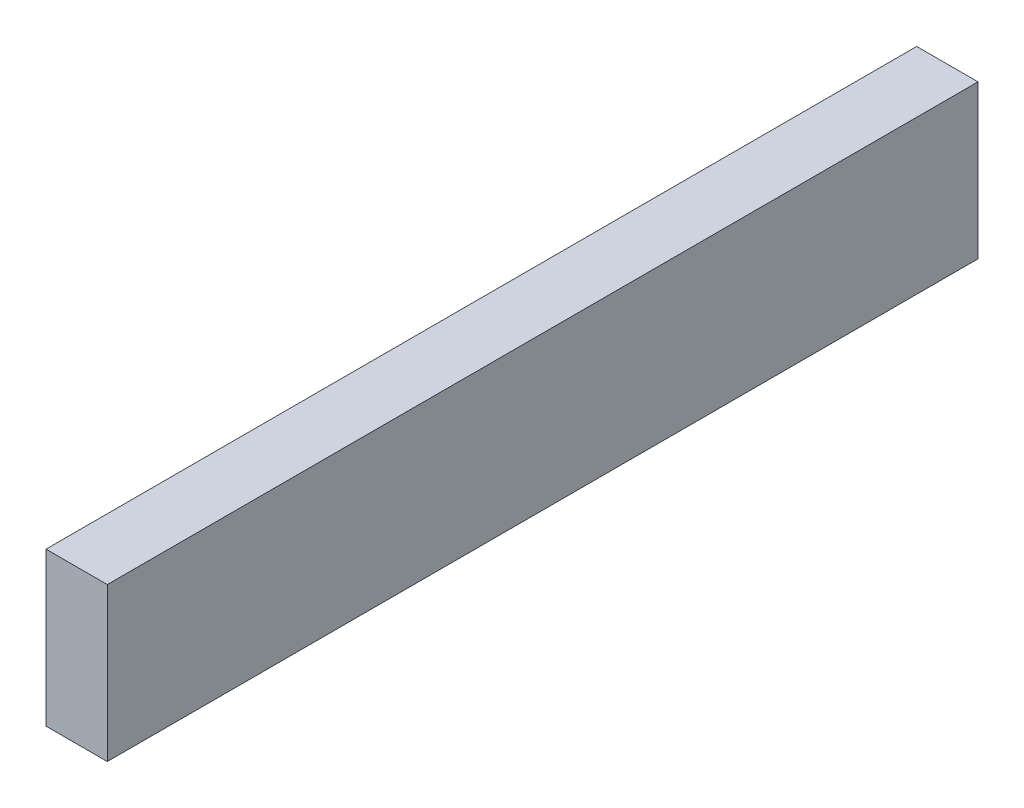
ISO-10303-21;
HEADER;
FILE_DESCRIPTION(('STEP AP214'),'2;1');
FILE_NAME('part.step','',(''),(''),'','','');
FILE_SCHEMA(('AUTOMOTIVE_DESIGN { 1 0 10303 214 1 1 1 1 }'));
ENDSEC;
DATA;
#1=APPLICATION_CONTEXT('core data for automotive mechanical design processes');
#2=APPLICATION_PROTOCOL_DEFINITION('international standard','automotive_design',2000,#1);
#3=PRODUCT_CONTEXT('',#1,'mechanical');
#4=PRODUCT('Part','Part','',(#3));
#5=PRODUCT_RELATED_PRODUCT_CATEGORY('part','',(#4));
#6=PRODUCT_DEFINITION_FORMATION('','',#4);
#7=PRODUCT_DEFINITION_CONTEXT('part definition',#1,'design');
#8=PRODUCT_DEFINITION('design','',#6,#7);
#9=PRODUCT_DEFINITION_SHAPE('','',#8);
#10=(LENGTH_UNIT() NAMED_UNIT(*) SI_UNIT(.MILLI.,.METRE.));
#11=(NAMED_UNIT(*) PLANE_ANGLE_UNIT() SI_UNIT($,.RADIAN.));
#12=(NAMED_UNIT(*) SI_UNIT($,.STERADIAN.) SOLID_ANGLE_UNIT());
#13=UNCERTAINTY_MEASURE_WITH_UNIT(LENGTH_MEASURE(1.E-05),#10,'distance_accuracy_value','');
#14=(GEOMETRIC_REPRESENTATION_CONTEXT(3) GLOBAL_UNCERTAINTY_ASSIGNED_CONTEXT((#13)) GLOBAL_UNIT_ASSIGNED_CONTEXT((#10,
#11,#12)) REPRESENTATION_CONTEXT('',''));
#15=CARTESIAN_POINT('',(0.,0.,0.));
#16=DIRECTION('',(0.,0.,1.));
#17=DIRECTION('',(1.,0.,0.));
#18=AXIS2_PLACEMENT_3D('',#15,#16,#17);
#19=CARTESIAN_POINT('',(0.,0.,1420.));
#20=DIRECTION('',(1.,0.,0.));
#21=DIRECTION('',(0.,0.,-1.));
#22=AXIS2_PLACEMENT_3D('',#19,#20,#21);
#23=PLANE('',#22);
#24=DIRECTION('',(0.,-1.,0.));
#25=VECTOR('',#24,1.);
#26=CARTESIAN_POINT('',(0.,0.,0.));
#27=LINE('',#26,#25);
#28=CARTESIAN_POINT('',(0.,250.,0.));
#29=VERTEX_POINT('',#28);
#30=CARTESIAN_POINT('',(0.,0.,0.));
#31=VERTEX_POINT('',#30);
#32=EDGE_CURVE('E98',#29,#31,#27,.T.);
#33=ORIENTED_EDGE('',*,*,#32,.T.);
#34=DIRECTION('',(0.,0.,-1.));
#35=VECTOR('',#34,1.);
#36=CARTESIAN_POINT('',(0.,0.,1420.));
#37=LINE('',#36,#35);
#38=CARTESIAN_POINT('',(0.,0.,1420.));
#39=VERTEX_POINT('',#38);
#40=EDGE_CURVE('E11',#39,#31,#37,.T.);
#41=ORIENTED_EDGE('',*,*,#40,.F.);
#42=DIRECTION('',(0.,-1.,0.));
#43=VECTOR('',#42,1.);
#44=CARTESIAN_POINT('',(0.,0.,1420.));
#45=LINE('',#44,#43);
#46=CARTESIAN_POINT('',(0.,250.,1420.));
#47=VERTEX_POINT('',#46);
#48=EDGE_CURVE('E86',#47,#39,#45,.T.);
#49=ORIENTED_EDGE('',*,*,#48,.F.);
#50=DIRECTION('',(0.,0.,-1.));
#51=VECTOR('',#50,1.);
#52=CARTESIAN_POINT('',(0.,250.,1420.));
#53=LINE('',#52,#51);
#54=EDGE_CURVE('E94',#47,#29,#53,.T.);
#55=ORIENTED_EDGE('',*,*,#54,.T.);
#56=EDGE_LOOP('',(#33,#41,#49,#55));
#57=FACE_BOUND('',#56,.T.);
#58=ADVANCED_FACE('F35',(#57),#23,.F.);
#59=CARTESIAN_POINT('',(0.,0.,1420.));
#60=DIRECTION('',(0.,1.,0.));
#61=DIRECTION('',(0.,0.,1.));
#62=AXIS2_PLACEMENT_3D('',#59,#60,#61);
#63=PLANE('',#62);
#64=DIRECTION('',(1.,0.,0.));
#65=VECTOR('',#64,1.);
#66=CARTESIAN_POINT('',(0.,0.,0.));
#67=LINE('',#66,#65);
#68=CARTESIAN_POINT('',(100.,0.,0.));
#69=VERTEX_POINT('',#68);
#70=EDGE_CURVE('E90',#31,#69,#67,.T.);
#71=ORIENTED_EDGE('',*,*,#70,.T.);
#72=DIRECTION('',(0.,0.,-1.));
#73=VECTOR('',#72,1.);
#74=CARTESIAN_POINT('',(100.,0.,1420.));
#75=LINE('',#74,#73);
#76=CARTESIAN_POINT('',(100.,0.,1420.));
#77=VERTEX_POINT('',#76);
#78=EDGE_CURVE('E43',#77,#69,#75,.T.);
#79=ORIENTED_EDGE('',*,*,#78,.F.);
#80=DIRECTION('',(1.,0.,0.));
#81=VECTOR('',#80,1.);
#82=CARTESIAN_POINT('',(0.,0.,1420.));
#83=LINE('',#82,#81);
#84=EDGE_CURVE('E81',#39,#77,#83,.T.);
#85=ORIENTED_EDGE('',*,*,#84,.F.);
#86=ORIENTED_EDGE('',*,*,#40,.T.);
#87=EDGE_LOOP('',(#71,#79,#85,#86));
#88=FACE_BOUND('',#87,.T.);
#89=ADVANCED_FACE('F89',(#88),#63,.F.);
#90=CARTESIAN_POINT('',(100.,0.,1420.));
#91=DIRECTION('',(-1.,0.,0.));
#92=DIRECTION('',(0.,0.,1.));
#93=AXIS2_PLACEMENT_3D('',#90,#91,#92);
#94=PLANE('',#93);
#95=DIRECTION('',(0.,1.,0.));
#96=VECTOR('',#95,1.);
#97=CARTESIAN_POINT('',(100.,0.,0.));
#98=LINE('',#97,#96);
#99=CARTESIAN_POINT('',(100.,250.,0.));
#100=VERTEX_POINT('',#99);
#101=EDGE_CURVE('E68',#69,#100,#98,.T.);
#102=ORIENTED_EDGE('',*,*,#101,.T.);
#103=DIRECTION('',(0.,0.,-1.));
#104=VECTOR('',#103,1.);
#105=CARTESIAN_POINT('',(100.,250.,1420.));
#106=LINE('',#105,#104);
#107=CARTESIAN_POINT('',(100.,250.,1420.));
#108=VERTEX_POINT('',#107);
#109=EDGE_CURVE('E91',#108,#100,#106,.T.);
#110=ORIENTED_EDGE('',*,*,#109,.F.);
#111=DIRECTION('',(0.,1.,0.));
#112=VECTOR('',#111,1.);
#113=CARTESIAN_POINT('',(100.,0.,1420.));
#114=LINE('',#113,#112);
#115=EDGE_CURVE('E84',#77,#108,#114,.T.);
#116=ORIENTED_EDGE('',*,*,#115,.F.);
#117=ORIENTED_EDGE('',*,*,#78,.T.);
#118=EDGE_LOOP('',(#102,#110,#116,#117));
#119=FACE_BOUND('',#118,.T.);
#120=ADVANCED_FACE('F92',(#119),#94,.F.);
#121=CARTESIAN_POINT('',(0.,250.,1420.));
#122=DIRECTION('',(0.,-1.,0.));
#123=DIRECTION('',(0.,0.,-1.));
#124=AXIS2_PLACEMENT_3D('',#121,#122,#123);
#125=PLANE('',#124);
#126=DIRECTION('',(-1.,0.,0.));
#127=VECTOR('',#126,1.);
#128=CARTESIAN_POINT('',(0.,250.,0.));
#129=LINE('',#128,#127);
#130=EDGE_CURVE('E74',#100,#29,#129,.T.);
#131=ORIENTED_EDGE('',*,*,#130,.T.);
#132=ORIENTED_EDGE('',*,*,#54,.F.);
#133=DIRECTION('',(-1.,0.,0.));
#134=VECTOR('',#133,1.);
#135=CARTESIAN_POINT('',(0.,250.,1420.));
#136=LINE('',#135,#134);
#137=EDGE_CURVE('E51',#108,#47,#136,.T.);
#138=ORIENTED_EDGE('',*,*,#137,.F.);
#139=ORIENTED_EDGE('',*,*,#109,.T.);
#140=EDGE_LOOP('',(#131,#132,#138,#139));
#141=FACE_BOUND('',#140,.T.);
#142=ADVANCED_FACE('F105',(#141),#125,.F.);
#143=CARTESIAN_POINT('',(0.,0.,1420.));
#144=DIRECTION('',(0.,0.,-1.));
#145=DIRECTION('',(-1.,0.,0.));
#146=AXIS2_PLACEMENT_3D('',#143,#144,#145);
#147=PLANE('',#146);
#148=ORIENTED_EDGE('',*,*,#48,.T.);
#149=ORIENTED_EDGE('',*,*,#84,.T.);
#150=ORIENTED_EDGE('',*,*,#115,.T.);
#151=ORIENTED_EDGE('',*,*,#137,.T.);
#152=EDGE_LOOP('',(#148,#149,#150,#151));
#153=FACE_BOUND('',#152,.T.);
#154=ADVANCED_FACE('F82',(#153),#147,.F.);
#155=CARTESIAN_POINT('',(0.,0.,0.));
#156=DIRECTION('',(0.,0.,-1.));
#157=DIRECTION('',(-1.,0.,0.));
#158=AXIS2_PLACEMENT_3D('',#155,#156,#157);
#159=PLANE('',#158);
#160=ORIENTED_EDGE('',*,*,#32,.F.);
#161=ORIENTED_EDGE('',*,*,#130,.F.);
#162=ORIENTED_EDGE('',*,*,#101,.F.);
#163=ORIENTED_EDGE('',*,*,#70,.F.);
#164=EDGE_LOOP('',(#160,#161,#162,#163));
#165=FACE_BOUND('',#164,.T.);
#166=ADVANCED_FACE('F108',(#165),#159,.T.);
#167=CLOSED_SHELL('',(#58,#89,#120,#142,#154,#166));
#168=MANIFOLD_SOLID_BREP('B2',#167);
#169=ADVANCED_BREP_SHAPE_REPRESENTATION('',(#18,#168),#14);
#170=SHAPE_DEFINITION_REPRESENTATION(#9,#169);
ENDSEC;
END-ISO-10303-21;
